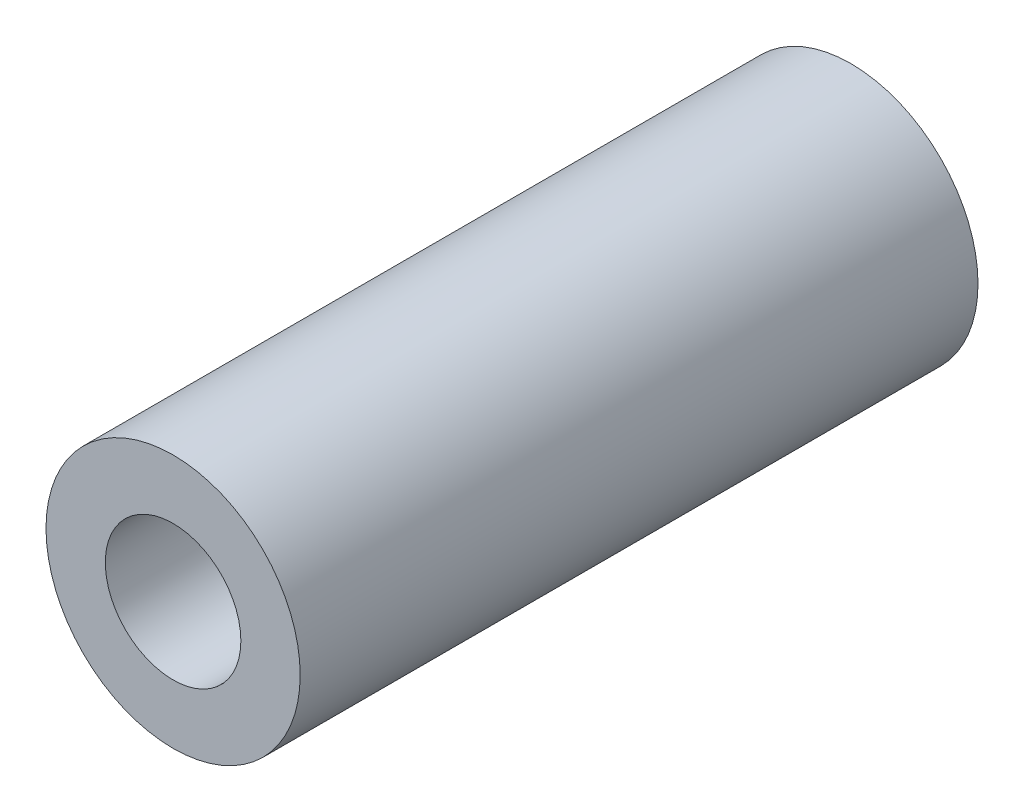
ISO-10303-21;
HEADER;
FILE_DESCRIPTION(('STEP AP214'),'2;1');
FILE_NAME('part.step','',(''),(''),'','','');
FILE_SCHEMA(('AUTOMOTIVE_DESIGN { 1 0 10303 214 1 1 1 1 }'));
ENDSEC;
DATA;
#1=APPLICATION_CONTEXT('core data for automotive mechanical design processes');
#2=APPLICATION_PROTOCOL_DEFINITION('international standard','automotive_design',2000,#1);
#3=PRODUCT_CONTEXT('',#1,'mechanical');
#4=PRODUCT('Part','Part','',(#3));
#5=PRODUCT_RELATED_PRODUCT_CATEGORY('part','',(#4));
#6=PRODUCT_DEFINITION_FORMATION('','',#4);
#7=PRODUCT_DEFINITION_CONTEXT('part definition',#1,'design');
#8=PRODUCT_DEFINITION('design','',#6,#7);
#9=PRODUCT_DEFINITION_SHAPE('','',#8);
#10=(LENGTH_UNIT() NAMED_UNIT(*) SI_UNIT(.MILLI.,.METRE.));
#11=(NAMED_UNIT(*) PLANE_ANGLE_UNIT() SI_UNIT($,.RADIAN.));
#12=(NAMED_UNIT(*) SI_UNIT($,.STERADIAN.) SOLID_ANGLE_UNIT());
#13=UNCERTAINTY_MEASURE_WITH_UNIT(LENGTH_MEASURE(1.E-05),#10,'distance_accuracy_value','');
#14=(GEOMETRIC_REPRESENTATION_CONTEXT(3) GLOBAL_UNCERTAINTY_ASSIGNED_CONTEXT((#13)) GLOBAL_UNIT_ASSIGNED_CONTEXT((#10,
#11,#12)) REPRESENTATION_CONTEXT('',''));
#15=CARTESIAN_POINT('',(0.,0.,0.));
#16=DIRECTION('',(0.,0.,1.));
#17=DIRECTION('',(1.,0.,0.));
#18=AXIS2_PLACEMENT_3D('',#15,#16,#17);
#19=CARTESIAN_POINT('',(0.,0.,16.));
#20=DIRECTION('',(0.,0.,1.));
#21=DIRECTION('',(1.,0.,0.));
#22=AXIS2_PLACEMENT_3D('',#19,#20,#21);
#23=PLANE('',#22);
#24=CARTESIAN_POINT('',(0.,0.,16.));
#25=DIRECTION('',(0.,0.,1.));
#26=DIRECTION('',(1.,0.,0.));
#27=AXIS2_PLACEMENT_3D('',#24,#25,#26);
#28=CIRCLE('',#27,3.);
#29=CARTESIAN_POINT('',(3.,0.,16.));
#30=VERTEX_POINT('',#29);
#31=EDGE_CURVE('E10',#30,#30,#28,.T.);
#32=ORIENTED_EDGE('',*,*,#31,.T.);
#33=EDGE_LOOP('',(#32));
#34=FACE_BOUND('',#33,.T.);
#35=CARTESIAN_POINT('',(0.,0.,16.));
#36=DIRECTION('',(0.,0.,1.));
#37=DIRECTION('',(1.,0.,0.));
#38=AXIS2_PLACEMENT_3D('',#35,#36,#37);
#39=CIRCLE('',#38,1.6);
#40=CARTESIAN_POINT('',(1.6,0.,16.));
#41=VERTEX_POINT('',#40);
#42=EDGE_CURVE('E50',#41,#41,#39,.T.);
#43=ORIENTED_EDGE('',*,*,#42,.F.);
#44=EDGE_LOOP('',(#43));
#45=FACE_BOUND('',#44,.T.);
#46=ADVANCED_FACE('F37',(#34,#45),#23,.T.);
#47=CARTESIAN_POINT('',(0.,0.,0.));
#48=DIRECTION('',(0.,0.,1.));
#49=DIRECTION('',(1.,0.,0.));
#50=AXIS2_PLACEMENT_3D('',#47,#48,#49);
#51=PLANE('',#50);
#52=CARTESIAN_POINT('',(0.,0.,0.));
#53=DIRECTION('',(0.,0.,1.));
#54=DIRECTION('',(1.,0.,0.));
#55=AXIS2_PLACEMENT_3D('',#52,#53,#54);
#56=CIRCLE('',#55,3.);
#57=CARTESIAN_POINT('',(3.,0.,0.));
#58=VERTEX_POINT('',#57);
#59=EDGE_CURVE('E41',#58,#58,#56,.T.);
#60=ORIENTED_EDGE('',*,*,#59,.F.);
#61=EDGE_LOOP('',(#60));
#62=FACE_BOUND('',#61,.T.);
#63=CARTESIAN_POINT('',(0.,0.,0.));
#64=DIRECTION('',(0.,0.,1.));
#65=DIRECTION('',(1.,0.,0.));
#66=AXIS2_PLACEMENT_3D('',#63,#64,#65);
#67=CIRCLE('',#66,1.6);
#68=CARTESIAN_POINT('',(1.6,0.,0.));
#69=VERTEX_POINT('',#68);
#70=EDGE_CURVE('E52',#69,#69,#67,.T.);
#71=ORIENTED_EDGE('',*,*,#70,.T.);
#72=EDGE_LOOP('',(#71));
#73=FACE_BOUND('',#72,.T.);
#74=ADVANCED_FACE('F64',(#62,#73),#51,.F.);
#75=CARTESIAN_POINT('',(0.,0.,16.));
#76=DIRECTION('',(0.,0.,-1.));
#77=DIRECTION('',(-1.,0.,0.));
#78=AXIS2_PLACEMENT_3D('',#75,#76,#77);
#79=CYLINDRICAL_SURFACE('',#78,3.);
#80=ORIENTED_EDGE('',*,*,#31,.F.);
#81=EDGE_LOOP('',(#80));
#82=FACE_BOUND('',#81,.T.);
#83=ORIENTED_EDGE('',*,*,#59,.T.);
#84=EDGE_LOOP('',(#83));
#85=FACE_BOUND('',#84,.T.);
#86=ADVANCED_FACE('F39',(#82,#85),#79,.T.);
#87=CARTESIAN_POINT('',(0.,0.,16.));
#88=DIRECTION('',(0.,0.,-1.));
#89=DIRECTION('',(-1.,0.,0.));
#90=AXIS2_PLACEMENT_3D('',#87,#88,#89);
#91=CYLINDRICAL_SURFACE('',#90,1.6);
#92=ORIENTED_EDGE('',*,*,#42,.T.);
#93=EDGE_LOOP('',(#92));
#94=FACE_BOUND('',#93,.T.);
#95=ORIENTED_EDGE('',*,*,#70,.F.);
#96=EDGE_LOOP('',(#95));
#97=FACE_BOUND('',#96,.T.);
#98=ADVANCED_FACE('F60',(#94,#97),#91,.F.);
#99=CLOSED_SHELL('',(#46,#74,#86,#98));
#100=MANIFOLD_SOLID_BREP('B2',#99);
#101=ADVANCED_BREP_SHAPE_REPRESENTATION('',(#18,#100),#14);
#102=SHAPE_DEFINITION_REPRESENTATION(#9,#101);
ENDSEC;
END-ISO-10303-21;
